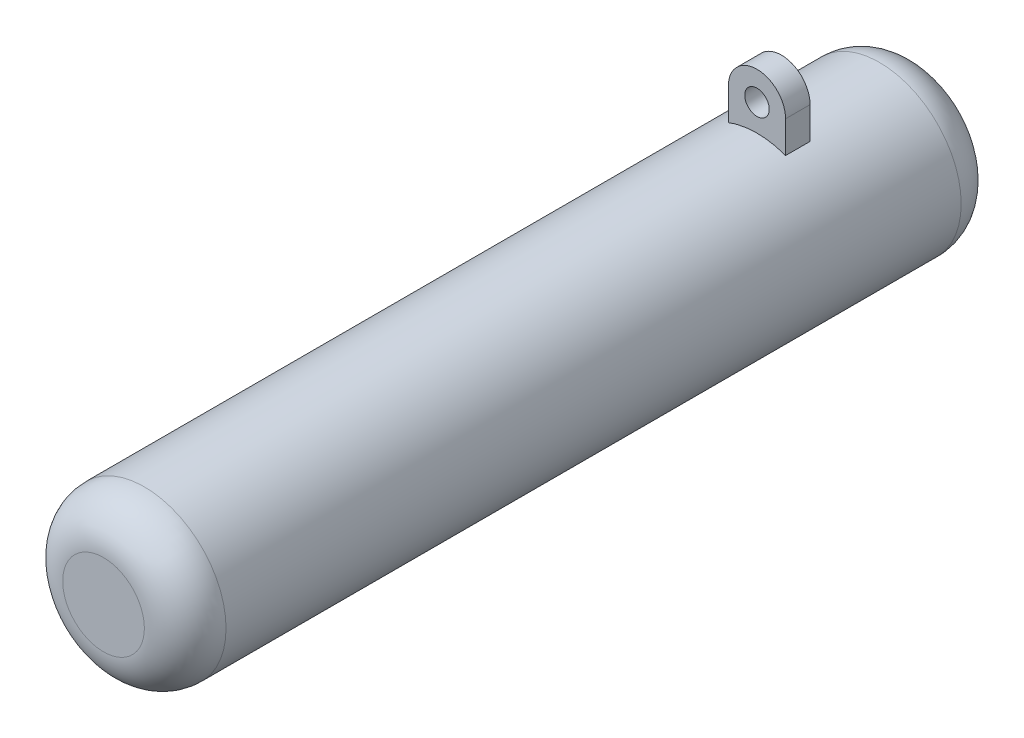
ISO-10303-21;
HEADER;
FILE_DESCRIPTION(('STEP AP214'),'2;1');
FILE_NAME('part.step','',(''),(''),'','','');
FILE_SCHEMA(('AUTOMOTIVE_DESIGN { 1 0 10303 214 1 1 1 1 }'));
ENDSEC;
DATA;
#1=APPLICATION_CONTEXT('core data for automotive mechanical design processes');
#2=APPLICATION_PROTOCOL_DEFINITION('international standard','automotive_design',2000,#1);
#3=PRODUCT_CONTEXT('',#1,'mechanical');
#4=PRODUCT('Part','Part','',(#3));
#5=PRODUCT_RELATED_PRODUCT_CATEGORY('part','',(#4));
#6=PRODUCT_DEFINITION_FORMATION('','',#4);
#7=PRODUCT_DEFINITION_CONTEXT('part definition',#1,'design');
#8=PRODUCT_DEFINITION('design','',#6,#7);
#9=PRODUCT_DEFINITION_SHAPE('','',#8);
#10=(LENGTH_UNIT() NAMED_UNIT(*) SI_UNIT(.MILLI.,.METRE.));
#11=(NAMED_UNIT(*) PLANE_ANGLE_UNIT() SI_UNIT($,.RADIAN.));
#12=(NAMED_UNIT(*) SI_UNIT($,.STERADIAN.) SOLID_ANGLE_UNIT());
#13=UNCERTAINTY_MEASURE_WITH_UNIT(LENGTH_MEASURE(1.E-05),#10,'distance_accuracy_value','');
#14=(GEOMETRIC_REPRESENTATION_CONTEXT(3) GLOBAL_UNCERTAINTY_ASSIGNED_CONTEXT((#13)) GLOBAL_UNIT_ASSIGNED_CONTEXT((#10,
#11,#12)) REPRESENTATION_CONTEXT('',''));
#15=CARTESIAN_POINT('',(0.,0.,0.));
#16=DIRECTION('',(0.,0.,1.));
#17=DIRECTION('',(1.,0.,0.));
#18=AXIS2_PLACEMENT_3D('',#15,#16,#17);
#19=CARTESIAN_POINT('',(0.,13.2702481088696,17.));
#20=DIRECTION('',(0.,0.,1.));
#21=DIRECTION('',(1.,0.,0.));
#22=AXIS2_PLACEMENT_3D('',#19,#20,#21);
#23=CYLINDRICAL_SURFACE('',#22,3.5);
#24=CARTESIAN_POINT('',(0.,13.2702481088696,20.));
#25=DIRECTION('',(0.,0.,1.));
#26=DIRECTION('',(-1.,0.,0.));
#27=AXIS2_PLACEMENT_3D('',#24,#25,#26);
#28=CIRCLE('',#27,3.5);
#29=CARTESIAN_POINT('',(3.5,13.2702481088696,20.));
#30=VERTEX_POINT('',#29);
#31=CARTESIAN_POINT('',(-3.5,13.2702481088696,20.));
#32=VERTEX_POINT('',#31);
#33=EDGE_CURVE('E109',#30,#32,#28,.T.);
#34=ORIENTED_EDGE('',*,*,#33,.F.);
#35=DIRECTION('',(0.,0.,1.));
#36=VECTOR('',#35,1.);
#37=CARTESIAN_POINT('',(3.5,13.2702481088696,17.));
#38=LINE('',#37,#36);
#39=CARTESIAN_POINT('',(3.5,13.2702481088696,17.));
#40=VERTEX_POINT('',#39);
#41=EDGE_CURVE('E12',#40,#30,#38,.T.);
#42=ORIENTED_EDGE('',*,*,#41,.F.);
#43=CARTESIAN_POINT('',(0.,13.2702481088696,17.));
#44=DIRECTION('',(0.,0.,1.));
#45=DIRECTION('',(-1.,0.,0.));
#46=AXIS2_PLACEMENT_3D('',#43,#44,#45);
#47=CIRCLE('',#46,3.5);
#48=CARTESIAN_POINT('',(-3.5,13.2702481088696,17.));
#49=VERTEX_POINT('',#48);
#50=EDGE_CURVE('E102',#40,#49,#47,.T.);
#51=ORIENTED_EDGE('',*,*,#50,.T.);
#52=DIRECTION('',(0.,0.,1.));
#53=VECTOR('',#52,1.);
#54=CARTESIAN_POINT('',(-3.5,13.2702481088696,17.));
#55=LINE('',#54,#53);
#56=EDGE_CURVE('E47',#49,#32,#55,.T.);
#57=ORIENTED_EDGE('',*,*,#56,.T.);
#58=EDGE_LOOP('',(#34,#42,#51,#57));
#59=FACE_BOUND('',#58,.T.);
#60=ADVANCED_FACE('F44',(#59),#23,.T.);
#61=CARTESIAN_POINT('',(3.5,9.3674969975976,17.));
#62=DIRECTION('',(1.,0.,0.));
#63=DIRECTION('',(0.,0.,-1.));
#64=AXIS2_PLACEMENT_3D('',#61,#62,#63);
#65=PLANE('',#64);
#66=DIRECTION('',(0.,1.,0.));
#67=VECTOR('',#66,1.);
#68=CARTESIAN_POINT('',(3.5,9.3674969975976,20.));
#69=LINE('',#68,#67);
#70=CARTESIAN_POINT('',(3.5,9.3674969975976,20.));
#71=VERTEX_POINT('',#70);
#72=EDGE_CURVE('E104',#71,#30,#69,.T.);
#73=ORIENTED_EDGE('',*,*,#72,.F.);
#74=DIRECTION('',(0.,0.,1.));
#75=VECTOR('',#74,1.);
#76=CARTESIAN_POINT('',(3.5,9.3674969975976,17.));
#77=LINE('',#76,#75);
#78=CARTESIAN_POINT('',(3.5,9.3674969975976,17.));
#79=VERTEX_POINT('',#78);
#80=EDGE_CURVE('E53',#79,#71,#77,.T.);
#81=ORIENTED_EDGE('',*,*,#80,.F.);
#82=DIRECTION('',(0.,1.,0.));
#83=VECTOR('',#82,1.);
#84=CARTESIAN_POINT('',(3.5,9.3674969975976,17.));
#85=LINE('',#84,#83);
#86=EDGE_CURVE('E99',#79,#40,#85,.T.);
#87=ORIENTED_EDGE('',*,*,#86,.T.);
#88=ORIENTED_EDGE('',*,*,#41,.T.);
#89=EDGE_LOOP('',(#73,#81,#87,#88));
#90=FACE_BOUND('',#89,.T.);
#91=ADVANCED_FACE('F120',(#90),#65,.T.);
#92=CARTESIAN_POINT('',(0.,1.6826817716975E-13,17.));
#93=DIRECTION('',(0.,0.,1.));
#94=DIRECTION('',(1.,0.,0.));
#95=AXIS2_PLACEMENT_3D('',#92,#93,#94);
#96=CYLINDRICAL_SURFACE('',#95,9.99999999999984);
#97=CARTESIAN_POINT('',(0.,1.6826817716975E-13,20.));
#98=DIRECTION('',(0.,0.,-1.));
#99=DIRECTION('',(-1.,0.,0.));
#100=AXIS2_PLACEMENT_3D('',#97,#98,#99);
#101=CIRCLE('',#100,9.99999999999984);
#102=CARTESIAN_POINT('',(-3.5,9.3674969975976,20.));
#103=VERTEX_POINT('',#102);
#104=EDGE_CURVE('E94',#103,#71,#101,.T.);
#105=ORIENTED_EDGE('',*,*,#104,.F.);
#106=DIRECTION('',(0.,0.,1.));
#107=VECTOR('',#106,1.);
#108=CARTESIAN_POINT('',(-3.5,9.3674969975976,17.));
#109=LINE('',#108,#107);
#110=CARTESIAN_POINT('',(-3.5,9.3674969975976,17.));
#111=VERTEX_POINT('',#110);
#112=EDGE_CURVE('E89',#111,#103,#109,.T.);
#113=ORIENTED_EDGE('',*,*,#112,.F.);
#114=CARTESIAN_POINT('',(0.,1.6826817716975E-13,17.));
#115=DIRECTION('',(0.,0.,-1.));
#116=DIRECTION('',(-1.,0.,0.));
#117=AXIS2_PLACEMENT_3D('',#114,#115,#116);
#118=CIRCLE('',#117,9.99999999999984);
#119=EDGE_CURVE('E92',#111,#79,#118,.T.);
#120=ORIENTED_EDGE('',*,*,#119,.T.);
#121=ORIENTED_EDGE('',*,*,#80,.T.);
#122=EDGE_LOOP('',(#105,#113,#120,#121));
#123=FACE_BOUND('',#122,.T.);
#124=ADVANCED_FACE('F91',(#123),#96,.F.);
#125=CARTESIAN_POINT('',(-3.5,9.3674969975976,17.));
#126=DIRECTION('',(-1.,0.,0.));
#127=DIRECTION('',(0.,0.,1.));
#128=AXIS2_PLACEMENT_3D('',#125,#126,#127);
#129=PLANE('',#128);
#130=DIRECTION('',(0.,-1.,0.));
#131=VECTOR('',#130,1.);
#132=CARTESIAN_POINT('',(-3.5,9.3674969975976,20.));
#133=LINE('',#132,#131);
#134=EDGE_CURVE('E112',#32,#103,#133,.T.);
#135=ORIENTED_EDGE('',*,*,#134,.F.);
#136=ORIENTED_EDGE('',*,*,#56,.F.);
#137=DIRECTION('',(0.,-1.,0.));
#138=VECTOR('',#137,1.);
#139=CARTESIAN_POINT('',(-3.5,9.3674969975976,17.));
#140=LINE('',#139,#138);
#141=EDGE_CURVE('E98',#49,#111,#140,.T.);
#142=ORIENTED_EDGE('',*,*,#141,.T.);
#143=ORIENTED_EDGE('',*,*,#112,.T.);
#144=EDGE_LOOP('',(#135,#136,#142,#143));
#145=FACE_BOUND('',#144,.T.);
#146=ADVANCED_FACE('F101',(#145),#129,.T.);
#147=CARTESIAN_POINT('',(0.,13.2702481088696,17.));
#148=DIRECTION('',(0.,0.,-1.));
#149=DIRECTION('',(-1.,0.,0.));
#150=AXIS2_PLACEMENT_3D('',#147,#148,#149);
#151=PLANE('',#150);
#152=CARTESIAN_POINT('',(0.,13.2702481088696,17.));
#153=DIRECTION('',(0.,0.,1.));
#154=DIRECTION('',(1.,0.,0.));
#155=AXIS2_PLACEMENT_3D('',#152,#153,#154);
#156=CIRCLE('',#155,1.5);
#157=CARTESIAN_POINT('',(1.5,13.2702481088696,17.));
#158=VERTEX_POINT('',#157);
#159=EDGE_CURVE('E113',#158,#158,#156,.T.);
#160=ORIENTED_EDGE('',*,*,#159,.T.);
#161=EDGE_LOOP('',(#160));
#162=FACE_BOUND('',#161,.T.);
#163=ORIENTED_EDGE('',*,*,#50,.F.);
#164=ORIENTED_EDGE('',*,*,#86,.F.);
#165=ORIENTED_EDGE('',*,*,#119,.F.);
#166=ORIENTED_EDGE('',*,*,#141,.F.);
#167=EDGE_LOOP('',(#163,#164,#165,#166));
#168=FACE_BOUND('',#167,.T.);
#169=ADVANCED_FACE('F97',(#162,#168),#151,.T.);
#170=CARTESIAN_POINT('',(0.,13.2702481088696,20.));
#171=DIRECTION('',(0.,0.,-1.));
#172=DIRECTION('',(-1.,0.,0.));
#173=AXIS2_PLACEMENT_3D('',#170,#171,#172);
#174=PLANE('',#173);
#175=CARTESIAN_POINT('',(0.,13.2702481088696,20.));
#176=DIRECTION('',(0.,0.,1.));
#177=DIRECTION('',(1.,0.,0.));
#178=AXIS2_PLACEMENT_3D('',#175,#176,#177);
#179=CIRCLE('',#178,1.5);
#180=CARTESIAN_POINT('',(1.5,13.2702481088696,20.));
#181=VERTEX_POINT('',#180);
#182=EDGE_CURVE('E150',#181,#181,#179,.T.);
#183=ORIENTED_EDGE('',*,*,#182,.F.);
#184=EDGE_LOOP('',(#183));
#185=FACE_BOUND('',#184,.T.);
#186=ORIENTED_EDGE('',*,*,#33,.T.);
#187=ORIENTED_EDGE('',*,*,#134,.T.);
#188=ORIENTED_EDGE('',*,*,#104,.T.);
#189=ORIENTED_EDGE('',*,*,#72,.T.);
#190=EDGE_LOOP('',(#186,#187,#188,#189));
#191=FACE_BOUND('',#190,.T.);
#192=ADVANCED_FACE('F119',(#185,#191),#174,.F.);
#193=CARTESIAN_POINT('',(0.,13.2702481088696,17.));
#194=DIRECTION('',(0.,0.,1.));
#195=DIRECTION('',(1.,0.,0.));
#196=AXIS2_PLACEMENT_3D('',#193,#194,#195);
#197=CYLINDRICAL_SURFACE('',#196,1.5);
#198=ORIENTED_EDGE('',*,*,#159,.F.);
#199=EDGE_LOOP('',(#198));
#200=FACE_BOUND('',#199,.T.);
#201=ORIENTED_EDGE('',*,*,#182,.T.);
#202=EDGE_LOOP('',(#201));
#203=FACE_BOUND('',#202,.T.);
#204=ADVANCED_FACE('F138',(#200,#203),#197,.F.);
#205=CLOSED_SHELL('',(#60,#91,#124,#146,#169,#192,#204));
#206=MANIFOLD_SOLID_BREP('B2',#205);
#207=CARTESIAN_POINT('',(0.,0.,100.));
#208=DIRECTION('',(0.,0.,-1.));
#209=DIRECTION('',(-1.,0.,0.));
#210=AXIS2_PLACEMENT_3D('',#207,#208,#209);
#211=CYLINDRICAL_SURFACE('',#210,10.);
#212=CARTESIAN_POINT('',(0.,0.,4.99999999999998));
#213=DIRECTION('',(0.,0.,1.));
#214=DIRECTION('',(1.,0.,0.));
#215=AXIS2_PLACEMENT_3D('',#212,#213,#214);
#216=CIRCLE('',#215,10.);
#217=CARTESIAN_POINT('',(10.,0.,4.99999999999998));
#218=VERTEX_POINT('',#217);
#219=EDGE_CURVE('E199',#218,#218,#216,.T.);
#220=ORIENTED_EDGE('',*,*,#219,.T.);
#221=EDGE_LOOP('',(#220));
#222=FACE_BOUND('',#221,.T.);
#223=CARTESIAN_POINT('',(0.,0.,95.));
#224=DIRECTION('',(0.,0.,1.));
#225=DIRECTION('',(1.,0.,0.));
#226=AXIS2_PLACEMENT_3D('',#223,#224,#225);
#227=CIRCLE('',#226,10.);
#228=CARTESIAN_POINT('',(10.,0.,95.));
#229=VERTEX_POINT('',#228);
#230=EDGE_CURVE('E203',#229,#229,#227,.F.);
#231=ORIENTED_EDGE('',*,*,#230,.T.);
#232=EDGE_LOOP('',(#231));
#233=FACE_BOUND('',#232,.T.);
#234=ADVANCED_FACE('F188',(#222,#233),#211,.T.);
#235=CARTESIAN_POINT('',(0.,0.,100.));
#236=DIRECTION('',(0.,0.,1.));
#237=DIRECTION('',(1.,0.,0.));
#238=AXIS2_PLACEMENT_3D('',#235,#236,#237);
#239=PLANE('',#238);
#240=CARTESIAN_POINT('',(0.,0.,100.));
#241=DIRECTION('',(0.,0.,1.));
#242=DIRECTION('',(1.,0.,0.));
#243=AXIS2_PLACEMENT_3D('',#240,#241,#242);
#244=CIRCLE('',#243,5.);
#245=CARTESIAN_POINT('',(5.,0.,100.));
#246=VERTEX_POINT('',#245);
#247=EDGE_CURVE('E43',#246,#246,#244,.T.);
#248=ORIENTED_EDGE('',*,*,#247,.T.);
#249=EDGE_LOOP('',(#248));
#250=FACE_BOUND('',#249,.T.);
#251=ADVANCED_FACE('F219',(#250),#239,.T.);
#252=CARTESIAN_POINT('',(0.,0.,0.));
#253=DIRECTION('',(0.,0.,1.));
#254=DIRECTION('',(1.,0.,0.));
#255=AXIS2_PLACEMENT_3D('',#252,#253,#254);
#256=PLANE('',#255);
#257=CARTESIAN_POINT('',(0.,0.,0.));
#258=DIRECTION('',(0.,0.,1.));
#259=DIRECTION('',(1.,0.,0.));
#260=AXIS2_PLACEMENT_3D('',#257,#258,#259);
#261=CIRCLE('',#260,5.);
#262=CARTESIAN_POINT('',(5.,0.,0.));
#263=VERTEX_POINT('',#262);
#264=EDGE_CURVE('E195',#263,#263,#261,.F.);
#265=ORIENTED_EDGE('',*,*,#264,.T.);
#266=EDGE_LOOP('',(#265));
#267=FACE_BOUND('',#266,.T.);
#268=ADVANCED_FACE('F216',(#267),#256,.F.);
#269=CARTESIAN_POINT('',(0.,0.,5.));
#270=DIRECTION('',(0.,0.,1.));
#271=DIRECTION('',(1.,0.,0.));
#272=AXIS2_PLACEMENT_3D('',#269,#270,#271);
#273=DEGENERATE_TOROIDAL_SURFACE('',#272,5.,5.,.T.);
#274=ORIENTED_EDGE('',*,*,#264,.F.);
#275=EDGE_LOOP('',(#274));
#276=FACE_BOUND('',#275,.T.);
#277=ORIENTED_EDGE('',*,*,#219,.F.);
#278=EDGE_LOOP('',(#277));
#279=FACE_BOUND('',#278,.T.);
#280=ADVANCED_FACE('F212',(#276,#279),#273,.T.);
#281=CARTESIAN_POINT('',(0.,0.,95.));
#282=DIRECTION('',(0.,0.,1.));
#283=DIRECTION('',(1.,0.,0.));
#284=AXIS2_PLACEMENT_3D('',#281,#282,#283);
#285=DEGENERATE_TOROIDAL_SURFACE('',#284,5.,5.,.T.);
#286=ORIENTED_EDGE('',*,*,#230,.F.);
#287=EDGE_LOOP('',(#286));
#288=FACE_BOUND('',#287,.T.);
#289=ORIENTED_EDGE('',*,*,#247,.F.);
#290=EDGE_LOOP('',(#289));
#291=FACE_BOUND('',#290,.T.);
#292=ADVANCED_FACE('F190',(#288,#291),#285,.T.);
#293=CLOSED_SHELL('',(#234,#251,#268,#280,#292));
#294=MANIFOLD_SOLID_BREP('B6',#293);
#295=ADVANCED_BREP_SHAPE_REPRESENTATION('',(#18,#206,#294),#14);
#296=SHAPE_DEFINITION_REPRESENTATION(#9,#295);
ENDSEC;
END-ISO-10303-21;
